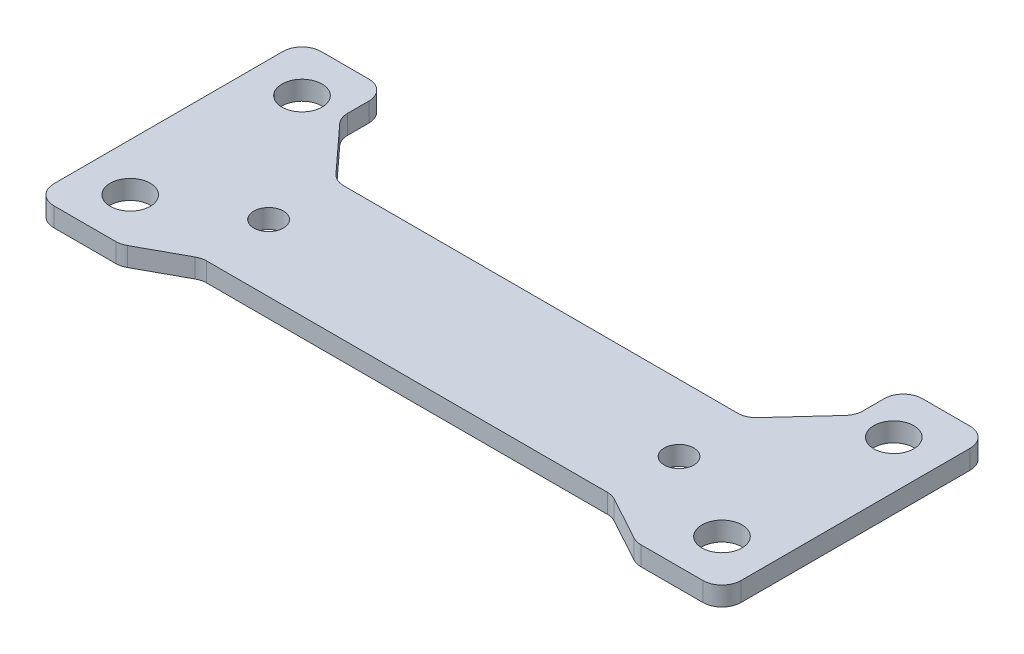
ISO-10303-21;
HEADER;
FILE_DESCRIPTION(('STEP AP214'),'2;1');
FILE_NAME('part.step','',(''),(''),'','','');
FILE_SCHEMA(('AUTOMOTIVE_DESIGN { 1 0 10303 214 1 1 1 1 }'));
ENDSEC;
DATA;
#1=APPLICATION_CONTEXT('core data for automotive mechanical design processes');
#2=APPLICATION_PROTOCOL_DEFINITION('international standard','automotive_design',2000,#1);
#3=PRODUCT_CONTEXT('',#1,'mechanical');
#4=PRODUCT('Part','Part','',(#3));
#5=PRODUCT_RELATED_PRODUCT_CATEGORY('part','',(#4));
#6=PRODUCT_DEFINITION_FORMATION('','',#4);
#7=PRODUCT_DEFINITION_CONTEXT('part definition',#1,'design');
#8=PRODUCT_DEFINITION('design','',#6,#7);
#9=PRODUCT_DEFINITION_SHAPE('','',#8);
#10=(LENGTH_UNIT() NAMED_UNIT(*) SI_UNIT(.MILLI.,.METRE.));
#11=(NAMED_UNIT(*) PLANE_ANGLE_UNIT() SI_UNIT($,.RADIAN.));
#12=(NAMED_UNIT(*) SI_UNIT($,.STERADIAN.) SOLID_ANGLE_UNIT());
#13=UNCERTAINTY_MEASURE_WITH_UNIT(LENGTH_MEASURE(1.E-05),#10,'distance_accuracy_value','');
#14=(GEOMETRIC_REPRESENTATION_CONTEXT(3) GLOBAL_UNCERTAINTY_ASSIGNED_CONTEXT((#13)) GLOBAL_UNIT_ASSIGNED_CONTEXT((#10,
#11,#12)) REPRESENTATION_CONTEXT('',''));
#15=CARTESIAN_POINT('',(0.,0.,0.));
#16=DIRECTION('',(0.,0.,1.));
#17=DIRECTION('',(1.,0.,0.));
#18=AXIS2_PLACEMENT_3D('',#15,#16,#17);
#19=CARTESIAN_POINT('',(0.,2.,5.));
#20=DIRECTION('',(0.,0.,-1.));
#21=DIRECTION('',(-1.,0.,0.));
#22=AXIS2_PLACEMENT_3D('',#19,#20,#21);
#23=PLANE('',#22);
#24=DIRECTION('',(1.,0.,0.));
#25=VECTOR('',#24,1.);
#26=CARTESIAN_POINT('',(0.,2.,5.));
#27=LINE('',#26,#25);
#28=CARTESIAN_POINT('',(-3.4900119712861,2.,5.));
#29=VERTEX_POINT('',#28);
#30=CARTESIAN_POINT('',(2.99999999999999,2.,5.));
#31=VERTEX_POINT('',#30);
#32=EDGE_CURVE('E242',#29,#31,#27,.T.);
#33=ORIENTED_EDGE('',*,*,#32,.F.);
#34=DIRECTION('',(0.,-1.,0.));
#35=VECTOR('',#34,1.);
#36=CARTESIAN_POINT('',(-3.4900119712861,2.,5.));
#37=LINE('',#36,#35);
#38=CARTESIAN_POINT('',(-3.4900119712861,0.,5.));
#39=VERTEX_POINT('',#38);
#40=EDGE_CURVE('E227',#29,#39,#37,.T.);
#41=ORIENTED_EDGE('',*,*,#40,.T.);
#42=DIRECTION('',(1.,0.,0.));
#43=VECTOR('',#42,1.);
#44=CARTESIAN_POINT('',(0.,0.,5.));
#45=LINE('',#44,#43);
#46=CARTESIAN_POINT('',(2.99999999999999,0.,5.));
#47=VERTEX_POINT('',#46);
#48=EDGE_CURVE('E239',#39,#47,#45,.T.);
#49=ORIENTED_EDGE('',*,*,#48,.T.);
#50=DIRECTION('',(0.,-1.,0.));
#51=VECTOR('',#50,1.);
#52=CARTESIAN_POINT('',(2.99999999999999,2.,5.));
#53=LINE('',#52,#51);
#54=EDGE_CURVE('E244',#47,#31,#53,.F.);
#55=ORIENTED_EDGE('',*,*,#54,.T.);
#56=EDGE_LOOP('',(#33,#41,#49,#55));
#57=FACE_BOUND('',#56,.T.);
#58=ADVANCED_FACE('F37',(#57),#23,.F.);
#59=CARTESIAN_POINT('',(4.99999999999999,2.,0.));
#60=DIRECTION('',(1.,0.,0.));
#61=DIRECTION('',(0.,0.,-1.));
#62=AXIS2_PLACEMENT_3D('',#59,#60,#61);
#63=PLANE('',#62);
#64=DIRECTION('',(0.,0.,1.));
#65=VECTOR('',#64,1.);
#66=CARTESIAN_POINT('',(4.99999999999999,2.,0.));
#67=LINE('',#66,#65);
#68=CARTESIAN_POINT('',(4.99999999999999,2.,-21.));
#69=VERTEX_POINT('',#68);
#70=CARTESIAN_POINT('',(4.99999999999999,2.,3.));
#71=VERTEX_POINT('',#70);
#72=EDGE_CURVE('E593',#69,#71,#67,.T.);
#73=ORIENTED_EDGE('',*,*,#72,.T.);
#74=DIRECTION('',(0.,-1.,0.));
#75=VECTOR('',#74,1.);
#76=CARTESIAN_POINT('',(4.99999999999999,0.,3.));
#77=LINE('',#76,#75);
#78=CARTESIAN_POINT('',(4.99999999999999,0.,3.));
#79=VERTEX_POINT('',#78);
#80=EDGE_CURVE('E381',#71,#79,#77,.T.);
#81=ORIENTED_EDGE('',*,*,#80,.T.);
#82=DIRECTION('',(0.,0.,1.));
#83=VECTOR('',#82,1.);
#84=CARTESIAN_POINT('',(4.99999999999999,0.,0.));
#85=LINE('',#84,#83);
#86=CARTESIAN_POINT('',(4.99999999999999,0.,-21.));
#87=VERTEX_POINT('',#86);
#88=EDGE_CURVE('E250',#87,#79,#85,.T.);
#89=ORIENTED_EDGE('',*,*,#88,.F.);
#90=DIRECTION('',(0.,-1.,0.));
#91=VECTOR('',#90,1.);
#92=CARTESIAN_POINT('',(4.99999999999999,2.,-21.));
#93=LINE('',#92,#91);
#94=EDGE_CURVE('E379',#87,#69,#93,.F.);
#95=ORIENTED_EDGE('',*,*,#94,.T.);
#96=EDGE_LOOP('',(#73,#81,#89,#95));
#97=FACE_BOUND('',#96,.T.);
#98=ADVANCED_FACE('F501',(#97),#63,.T.);
#99=CARTESIAN_POINT('',(0.,2.,-23.));
#100=DIRECTION('',(0.,0.,-1.));
#101=DIRECTION('',(-1.,0.,0.));
#102=AXIS2_PLACEMENT_3D('',#99,#100,#101);
#103=PLANE('',#102);
#104=DIRECTION('',(1.,0.,0.));
#105=VECTOR('',#104,1.);
#106=CARTESIAN_POINT('',(0.,2.,-23.));
#107=LINE('',#106,#105);
#108=CARTESIAN_POINT('',(-1.99999999999999,2.,-23.));
#109=VERTEX_POINT('',#108);
#110=CARTESIAN_POINT('',(2.99999999999999,2.,-23.));
#111=VERTEX_POINT('',#110);
#112=EDGE_CURVE('E445',#109,#111,#107,.T.);
#113=ORIENTED_EDGE('',*,*,#112,.T.);
#114=DIRECTION('',(0.,-1.,0.));
#115=VECTOR('',#114,1.);
#116=CARTESIAN_POINT('',(2.99999999999999,2.,-23.));
#117=LINE('',#116,#115);
#118=CARTESIAN_POINT('',(2.99999999999999,0.,-23.));
#119=VERTEX_POINT('',#118);
#120=EDGE_CURVE('E391',#111,#119,#117,.T.);
#121=ORIENTED_EDGE('',*,*,#120,.T.);
#122=DIRECTION('',(1.,0.,0.));
#123=VECTOR('',#122,1.);
#124=CARTESIAN_POINT('',(0.,0.,-23.));
#125=LINE('',#124,#123);
#126=CARTESIAN_POINT('',(-1.99999999999999,0.,-23.));
#127=VERTEX_POINT('',#126);
#128=EDGE_CURVE('E252',#127,#119,#125,.T.);
#129=ORIENTED_EDGE('',*,*,#128,.F.);
#130=DIRECTION('',(0.,-1.,0.));
#131=VECTOR('',#130,1.);
#132=CARTESIAN_POINT('',(-1.99999999999999,2.,-23.));
#133=LINE('',#132,#131);
#134=EDGE_CURVE('E389',#127,#109,#133,.F.);
#135=ORIENTED_EDGE('',*,*,#134,.T.);
#136=EDGE_LOOP('',(#113,#121,#129,#135));
#137=FACE_BOUND('',#136,.T.);
#138=ADVANCED_FACE('F506',(#137),#103,.T.);
#139=CARTESIAN_POINT('',(-3.99999999999999,2.,0.));
#140=DIRECTION('',(1.,0.,0.));
#141=DIRECTION('',(0.,0.,-1.));
#142=AXIS2_PLACEMENT_3D('',#139,#140,#141);
#143=PLANE('',#142);
#144=DIRECTION('',(0.,0.,1.));
#145=VECTOR('',#144,1.);
#146=CARTESIAN_POINT('',(-3.99999999999999,0.,0.));
#147=LINE('',#146,#145);
#148=CARTESIAN_POINT('',(-3.99999999999999,0.,-21.));
#149=VERTEX_POINT('',#148);
#150=CARTESIAN_POINT('',(-3.99999999999999,0.,-18.777967381109));
#151=VERTEX_POINT('',#150);
#152=EDGE_CURVE('E260',#149,#151,#147,.T.);
#153=ORIENTED_EDGE('',*,*,#152,.T.);
#154=DIRECTION('',(0.,-1.,0.));
#155=VECTOR('',#154,1.);
#156=CARTESIAN_POINT('',(-3.99999999999999,2.,-18.777967381109));
#157=LINE('',#156,#155);
#158=CARTESIAN_POINT('',(-3.99999999999999,2.,-18.777967381109));
#159=VERTEX_POINT('',#158);
#160=EDGE_CURVE('E377',#151,#159,#157,.F.);
#161=ORIENTED_EDGE('',*,*,#160,.T.);
#162=DIRECTION('',(0.,0.,1.));
#163=VECTOR('',#162,1.);
#164=CARTESIAN_POINT('',(-3.99999999999999,2.,0.));
#165=LINE('',#164,#163);
#166=CARTESIAN_POINT('',(-3.99999999999999,2.,-21.));
#167=VERTEX_POINT('',#166);
#168=EDGE_CURVE('E436',#167,#159,#165,.T.);
#169=ORIENTED_EDGE('',*,*,#168,.F.);
#170=DIRECTION('',(0.,-1.,0.));
#171=VECTOR('',#170,1.);
#172=CARTESIAN_POINT('',(-3.99999999999999,0.,-21.));
#173=LINE('',#172,#171);
#174=EDGE_CURVE('E374',#167,#149,#173,.T.);
#175=ORIENTED_EDGE('',*,*,#174,.T.);
#176=EDGE_LOOP('',(#153,#161,#169,#175));
#177=FACE_BOUND('',#176,.T.);
#178=ADVANCED_FACE('F423',(#177),#143,.F.);
#179=CARTESIAN_POINT('',(-11.1396226415094,2.,-10.211320754717));
#180=DIRECTION('',(-0.737154140200741,0.,-0.675724628517347));
#181=DIRECTION('',(-0.675724628517347,0.,0.737154140200741));
#182=AXIS2_PLACEMENT_3D('',#179,#180,#181);
#183=PLANE('',#182);
#184=DIRECTION('',(0.675724628517347,0.,-0.737154140200741));
#185=VECTOR('',#184,1.);
#186=CARTESIAN_POINT('',(-11.1396226415094,0.,-10.211320754717));
#187=LINE('',#186,#185);
#188=CARTESIAN_POINT('',(-8.90549515228179,0.,-12.6485507429653));
#189=VERTEX_POINT('',#188);
#190=CARTESIAN_POINT('',(-4.52569171959851,0.,-17.4265181240743));
#191=VERTEX_POINT('',#190);
#192=EDGE_CURVE('E263',#189,#191,#187,.T.);
#193=ORIENTED_EDGE('',*,*,#192,.F.);
#194=DIRECTION('',(0.,-1.,0.));
#195=VECTOR('',#194,1.);
#196=CARTESIAN_POINT('',(-8.90549515228179,2.,-12.6485507429653));
#197=LINE('',#196,#195);
#198=CARTESIAN_POINT('',(-8.90549515228179,2.,-12.6485507429653));
#199=VERTEX_POINT('',#198);
#200=EDGE_CURVE('E372',#189,#199,#197,.F.);
#201=ORIENTED_EDGE('',*,*,#200,.T.);
#202=DIRECTION('',(0.675724628517347,0.,-0.737154140200741));
#203=VECTOR('',#202,1.);
#204=CARTESIAN_POINT('',(-11.1396226415094,2.,-10.211320754717));
#205=LINE('',#204,#203);
#206=CARTESIAN_POINT('',(-4.52569171959851,2.,-17.4265181240743));
#207=VERTEX_POINT('',#206);
#208=EDGE_CURVE('E434',#199,#207,#205,.T.);
#209=ORIENTED_EDGE('',*,*,#208,.T.);
#210=DIRECTION('',(0.,-1.,0.));
#211=VECTOR('',#210,1.);
#212=CARTESIAN_POINT('',(-4.52569171959851,2.,-17.4265181240743));
#213=LINE('',#212,#211);
#214=EDGE_CURVE('E369',#207,#191,#213,.T.);
#215=ORIENTED_EDGE('',*,*,#214,.T.);
#216=EDGE_LOOP('',(#193,#201,#209,#215));
#217=FACE_BOUND('',#216,.T.);
#218=ADVANCED_FACE('F438',(#217),#183,.T.);
#219=CARTESIAN_POINT('',(0.,2.,-12.));
#220=DIRECTION('',(0.,0.,1.));
#221=DIRECTION('',(1.,0.,0.));
#222=AXIS2_PLACEMENT_3D('',#219,#220,#221);
#223=PLANE('',#222);
#224=DIRECTION('',(-1.,0.,0.));
#225=VECTOR('',#224,1.);
#226=CARTESIAN_POINT('',(0.,0.,-12.));
#227=LINE('',#226,#225);
#228=CARTESIAN_POINT('',(-10.3798034326833,0.,-12.));
#229=VERTEX_POINT('',#228);
#230=CARTESIAN_POINT('',(-51.6201965673167,0.,-12.));
#231=VERTEX_POINT('',#230);
#232=EDGE_CURVE('E266',#229,#231,#227,.T.);
#233=ORIENTED_EDGE('',*,*,#232,.T.);
#234=DIRECTION('',(0.,-1.,0.));
#235=VECTOR('',#234,1.);
#236=CARTESIAN_POINT('',(-51.6201965673167,2.,-12.));
#237=LINE('',#236,#235);
#238=CARTESIAN_POINT('',(-51.6201965673167,2.,-12.));
#239=VERTEX_POINT('',#238);
#240=EDGE_CURVE('E367',#231,#239,#237,.F.);
#241=ORIENTED_EDGE('',*,*,#240,.T.);
#242=DIRECTION('',(-1.,0.,0.));
#243=VECTOR('',#242,1.);
#244=CARTESIAN_POINT('',(0.,2.,-12.));
#245=LINE('',#244,#243);
#246=CARTESIAN_POINT('',(-10.3798034326833,2.,-12.));
#247=VERTEX_POINT('',#246);
#248=EDGE_CURVE('E440',#247,#239,#245,.T.);
#249=ORIENTED_EDGE('',*,*,#248,.F.);
#250=DIRECTION('',(0.,-1.,0.));
#251=VECTOR('',#250,1.);
#252=CARTESIAN_POINT('',(-10.3798034326833,2.,-12.));
#253=LINE('',#252,#251);
#254=EDGE_CURVE('E364',#247,#229,#253,.T.);
#255=ORIENTED_EDGE('',*,*,#254,.T.);
#256=EDGE_LOOP('',(#233,#241,#249,#255));
#257=FACE_BOUND('',#256,.T.);
#258=ADVANCED_FACE('F615',(#257),#223,.F.);
#259=CARTESIAN_POINT('',(-22.5509433962264,2.,20.6716981132075));
#260=DIRECTION('',(-0.737154140200741,0.,0.675724628517346));
#261=DIRECTION('',(0.675724628517346,0.,0.737154140200741));
#262=AXIS2_PLACEMENT_3D('',#259,#260,#261);
#263=PLANE('',#262);
#264=DIRECTION('',(-0.675724628517346,0.,-0.737154140200741));
#265=VECTOR('',#264,1.);
#266=CARTESIAN_POINT('',(-22.5509433962264,0.,20.6716981132075));
#267=LINE('',#266,#265);
#268=CARTESIAN_POINT('',(-53.0945048477182,0.,-12.6485507429653));
#269=VERTEX_POINT('',#268);
#270=CARTESIAN_POINT('',(-57.4743082804015,0.,-17.4265181240744));
#271=VERTEX_POINT('',#270);
#272=EDGE_CURVE('E269',#269,#271,#267,.T.);
#273=ORIENTED_EDGE('',*,*,#272,.T.);
#274=DIRECTION('',(0.,-1.,0.));
#275=VECTOR('',#274,1.);
#276=CARTESIAN_POINT('',(-57.4743082804015,2.,-17.4265181240743));
#277=LINE('',#276,#275);
#278=CARTESIAN_POINT('',(-57.4743082804015,2.,-17.4265181240744));
#279=VERTEX_POINT('',#278);
#280=EDGE_CURVE('E362',#271,#279,#277,.F.);
#281=ORIENTED_EDGE('',*,*,#280,.T.);
#282=DIRECTION('',(-0.675724628517346,0.,-0.737154140200741));
#283=VECTOR('',#282,1.);
#284=CARTESIAN_POINT('',(-22.5509433962264,2.,20.6716981132075));
#285=LINE('',#284,#283);
#286=CARTESIAN_POINT('',(-53.0945048477182,2.,-12.6485507429653));
#287=VERTEX_POINT('',#286);
#288=EDGE_CURVE('E443',#287,#279,#285,.T.);
#289=ORIENTED_EDGE('',*,*,#288,.F.);
#290=DIRECTION('',(0.,-1.,0.));
#291=VECTOR('',#290,1.);
#292=CARTESIAN_POINT('',(-53.0945048477182,0.,-12.6485507429653));
#293=LINE('',#292,#291);
#294=EDGE_CURVE('E359',#287,#269,#293,.T.);
#295=ORIENTED_EDGE('',*,*,#294,.T.);
#296=EDGE_LOOP('',(#273,#281,#289,#295));
#297=FACE_BOUND('',#296,.T.);
#298=ADVANCED_FACE('F618',(#297),#263,.F.);
#299=CARTESIAN_POINT('',(-58.,2.,0.));
#300=DIRECTION('',(1.,0.,0.));
#301=DIRECTION('',(0.,0.,-1.));
#302=AXIS2_PLACEMENT_3D('',#299,#300,#301);
#303=PLANE('',#302);
#304=DIRECTION('',(0.,0.,1.));
#305=VECTOR('',#304,1.);
#306=CARTESIAN_POINT('',(-58.,2.,0.));
#307=LINE('',#306,#305);
#308=CARTESIAN_POINT('',(-58.,2.,-21.));
#309=VERTEX_POINT('',#308);
#310=CARTESIAN_POINT('',(-58.,2.,-18.777967381109));
#311=VERTEX_POINT('',#310);
#312=EDGE_CURVE('E451',#309,#311,#307,.T.);
#313=ORIENTED_EDGE('',*,*,#312,.T.);
#314=DIRECTION('',(0.,-1.,0.));
#315=VECTOR('',#314,1.);
#316=CARTESIAN_POINT('',(-58.,2.,-18.777967381109));
#317=LINE('',#316,#315);
#318=CARTESIAN_POINT('',(-58.,0.,-18.777967381109));
#319=VERTEX_POINT('',#318);
#320=EDGE_CURVE('E356',#311,#319,#317,.T.);
#321=ORIENTED_EDGE('',*,*,#320,.T.);
#322=DIRECTION('',(0.,0.,1.));
#323=VECTOR('',#322,1.);
#324=CARTESIAN_POINT('',(-58.,0.,0.));
#325=LINE('',#324,#323);
#326=CARTESIAN_POINT('',(-58.,0.,-21.));
#327=VERTEX_POINT('',#326);
#328=EDGE_CURVE('E272',#327,#319,#325,.T.);
#329=ORIENTED_EDGE('',*,*,#328,.F.);
#330=DIRECTION('',(0.,-1.,0.));
#331=VECTOR('',#330,1.);
#332=CARTESIAN_POINT('',(-58.,2.,-21.));
#333=LINE('',#332,#331);
#334=EDGE_CURVE('E354',#327,#309,#333,.F.);
#335=ORIENTED_EDGE('',*,*,#334,.T.);
#336=EDGE_LOOP('',(#313,#321,#329,#335));
#337=FACE_BOUND('',#336,.T.);
#338=ADVANCED_FACE('F622',(#337),#303,.T.);
#339=CARTESIAN_POINT('',(0.,2.,-23.));
#340=DIRECTION('',(0.,0.,-1.));
#341=DIRECTION('',(-1.,0.,0.));
#342=AXIS2_PLACEMENT_3D('',#339,#340,#341);
#343=PLANE('',#342);
#344=DIRECTION('',(1.,0.,0.));
#345=VECTOR('',#344,1.);
#346=CARTESIAN_POINT('',(0.,2.,-23.));
#347=LINE('',#346,#345);
#348=CARTESIAN_POINT('',(-65.,2.,-23.));
#349=VERTEX_POINT('',#348);
#350=CARTESIAN_POINT('',(-60.,2.,-23.));
#351=VERTEX_POINT('',#350);
#352=EDGE_CURVE('E454',#349,#351,#347,.T.);
#353=ORIENTED_EDGE('',*,*,#352,.T.);
#354=DIRECTION('',(0.,-1.,0.));
#355=VECTOR('',#354,1.);
#356=CARTESIAN_POINT('',(-60.,2.,-23.));
#357=LINE('',#356,#355);
#358=CARTESIAN_POINT('',(-60.,0.,-23.));
#359=VERTEX_POINT('',#358);
#360=EDGE_CURVE('E386',#351,#359,#357,.T.);
#361=ORIENTED_EDGE('',*,*,#360,.T.);
#362=DIRECTION('',(1.,0.,0.));
#363=VECTOR('',#362,1.);
#364=CARTESIAN_POINT('',(0.,0.,-23.));
#365=LINE('',#364,#363);
#366=CARTESIAN_POINT('',(-65.,0.,-23.));
#367=VERTEX_POINT('',#366);
#368=EDGE_CURVE('E275',#367,#359,#365,.T.);
#369=ORIENTED_EDGE('',*,*,#368,.F.);
#370=DIRECTION('',(0.,-1.,0.));
#371=VECTOR('',#370,1.);
#372=CARTESIAN_POINT('',(-65.,2.,-23.));
#373=LINE('',#372,#371);
#374=EDGE_CURVE('E384',#367,#349,#373,.F.);
#375=ORIENTED_EDGE('',*,*,#374,.T.);
#376=EDGE_LOOP('',(#353,#361,#369,#375));
#377=FACE_BOUND('',#376,.T.);
#378=ADVANCED_FACE('F626',(#377),#343,.T.);
#379=CARTESIAN_POINT('',(-67.,2.,0.));
#380=DIRECTION('',(1.,0.,0.));
#381=DIRECTION('',(0.,0.,-1.));
#382=AXIS2_PLACEMENT_3D('',#379,#380,#381);
#383=PLANE('',#382);
#384=DIRECTION('',(0.,0.,1.));
#385=VECTOR('',#384,1.);
#386=CARTESIAN_POINT('',(-67.,2.,0.));
#387=LINE('',#386,#385);
#388=CARTESIAN_POINT('',(-67.,2.,-21.));
#389=VERTEX_POINT('',#388);
#390=CARTESIAN_POINT('',(-67.,2.,3.));
#391=VERTEX_POINT('',#390);
#392=EDGE_CURVE('E457',#389,#391,#387,.T.);
#393=ORIENTED_EDGE('',*,*,#392,.F.);
#394=DIRECTION('',(0.,-1.,0.));
#395=VECTOR('',#394,1.);
#396=CARTESIAN_POINT('',(-67.,0.,-21.));
#397=LINE('',#396,#395);
#398=CARTESIAN_POINT('',(-67.,0.,-21.));
#399=VERTEX_POINT('',#398);
#400=EDGE_CURVE('E396',#389,#399,#397,.T.);
#401=ORIENTED_EDGE('',*,*,#400,.T.);
#402=DIRECTION('',(0.,0.,1.));
#403=VECTOR('',#402,1.);
#404=CARTESIAN_POINT('',(-67.,0.,0.));
#405=LINE('',#404,#403);
#406=CARTESIAN_POINT('',(-67.,0.,3.));
#407=VERTEX_POINT('',#406);
#408=EDGE_CURVE('E278',#399,#407,#405,.T.);
#409=ORIENTED_EDGE('',*,*,#408,.T.);
#410=DIRECTION('',(0.,-1.,0.));
#411=VECTOR('',#410,1.);
#412=CARTESIAN_POINT('',(-67.,2.,3.));
#413=LINE('',#412,#411);
#414=EDGE_CURVE('E394',#407,#391,#413,.F.);
#415=ORIENTED_EDGE('',*,*,#414,.T.);
#416=EDGE_LOOP('',(#393,#401,#409,#415));
#417=FACE_BOUND('',#416,.T.);
#418=ADVANCED_FACE('F568',(#417),#383,.F.);
#419=CARTESIAN_POINT('',(0.,2.,5.));
#420=DIRECTION('',(0.,0.,-1.));
#421=DIRECTION('',(-1.,0.,0.));
#422=AXIS2_PLACEMENT_3D('',#419,#420,#421);
#423=PLANE('',#422);
#424=DIRECTION('',(1.,0.,0.));
#425=VECTOR('',#424,1.);
#426=CARTESIAN_POINT('',(0.,0.,5.));
#427=LINE('',#426,#425);
#428=CARTESIAN_POINT('',(-65.,0.,5.));
#429=VERTEX_POINT('',#428);
#430=CARTESIAN_POINT('',(-58.5099880287139,0.,5.));
#431=VERTEX_POINT('',#430);
#432=EDGE_CURVE('E281',#429,#431,#427,.T.);
#433=ORIENTED_EDGE('',*,*,#432,.T.);
#434=DIRECTION('',(0.,-1.,0.));
#435=VECTOR('',#434,1.);
#436=CARTESIAN_POINT('',(-58.5099880287139,2.,5.));
#437=LINE('',#436,#435);
#438=CARTESIAN_POINT('',(-58.5099880287139,2.,5.));
#439=VERTEX_POINT('',#438);
#440=EDGE_CURVE('E352',#431,#439,#437,.F.);
#441=ORIENTED_EDGE('',*,*,#440,.T.);
#442=DIRECTION('',(1.,0.,0.));
#443=VECTOR('',#442,1.);
#444=CARTESIAN_POINT('',(0.,2.,5.));
#445=LINE('',#444,#443);
#446=CARTESIAN_POINT('',(-65.,2.,5.));
#447=VERTEX_POINT('',#446);
#448=EDGE_CURVE('E460',#447,#439,#445,.T.);
#449=ORIENTED_EDGE('',*,*,#448,.F.);
#450=DIRECTION('',(0.,-1.,0.));
#451=VECTOR('',#450,1.);
#452=CARTESIAN_POINT('',(-65.,2.,5.));
#453=LINE('',#452,#451);
#454=EDGE_CURVE('E349',#447,#429,#453,.T.);
#455=ORIENTED_EDGE('',*,*,#454,.T.);
#456=EDGE_LOOP('',(#433,#441,#449,#455));
#457=FACE_BOUND('',#456,.T.);
#458=ADVANCED_FACE('F575',(#457),#423,.F.);
#459=CARTESIAN_POINT('',(-11.1974522292994,2.,-20.5286624203822));
#460=DIRECTION('',(0.478852130680574,0.,0.877895572914384));
#461=DIRECTION('',(0.877895572914384,0.,-0.478852130680574));
#462=AXIS2_PLACEMENT_3D('',#459,#460,#461);
#463=PLANE('',#462);
#464=DIRECTION('',(-0.877895572914384,0.,0.478852130680574));
#465=VECTOR('',#464,1.);
#466=CARTESIAN_POINT('',(-11.1974522292994,2.,-20.5286624203822));
#467=LINE('',#466,#465);
#468=CARTESIAN_POINT('',(-52.9477162326473,2.,2.24420885417123));
#469=VERTEX_POINT('',#468);
#470=CARTESIAN_POINT('',(-57.5522837673527,2.,4.75579114582877));
#471=VERTEX_POINT('',#470);
#472=EDGE_CURVE('E463',#469,#471,#467,.T.);
#473=ORIENTED_EDGE('',*,*,#472,.T.);
#474=DIRECTION('',(0.,-1.,0.));
#475=VECTOR('',#474,1.);
#476=CARTESIAN_POINT('',(-57.5522837673527,0.,4.75579114582877));
#477=LINE('',#476,#475);
#478=CARTESIAN_POINT('',(-57.5522837673527,0.,4.75579114582877));
#479=VERTEX_POINT('',#478);
#480=EDGE_CURVE('E346',#471,#479,#477,.T.);
#481=ORIENTED_EDGE('',*,*,#480,.T.);
#482=DIRECTION('',(-0.877895572914384,0.,0.478852130680574));
#483=VECTOR('',#482,1.);
#484=CARTESIAN_POINT('',(-11.1974522292994,0.,-20.5286624203822));
#485=LINE('',#484,#483);
#486=CARTESIAN_POINT('',(-52.9477162326473,0.,2.24420885417123));
#487=VERTEX_POINT('',#486);
#488=EDGE_CURVE('E284',#487,#479,#485,.T.);
#489=ORIENTED_EDGE('',*,*,#488,.F.);
#490=DIRECTION('',(0.,-1.,0.));
#491=VECTOR('',#490,1.);
#492=CARTESIAN_POINT('',(-52.9477162326473,2.,2.24420885417123));
#493=LINE('',#492,#491);
#494=EDGE_CURVE('E344',#487,#469,#493,.F.);
#495=ORIENTED_EDGE('',*,*,#494,.T.);
#496=EDGE_LOOP('',(#473,#481,#489,#495));
#497=FACE_BOUND('',#496,.T.);
#498=ADVANCED_FACE('F580',(#497),#463,.T.);
#499=CARTESIAN_POINT('',(0.,2.,2.));
#500=DIRECTION('',(0.,0.,-1.));
#501=DIRECTION('',(-1.,0.,0.));
#502=AXIS2_PLACEMENT_3D('',#499,#500,#501);
#503=PLANE('',#502);
#504=DIRECTION('',(1.,0.,0.));
#505=VECTOR('',#504,1.);
#506=CARTESIAN_POINT('',(0.,0.,2.));
#507=LINE('',#506,#505);
#508=CARTESIAN_POINT('',(-51.9900119712861,0.,2.));
#509=VERTEX_POINT('',#508);
#510=CARTESIAN_POINT('',(-10.0099880287139,0.,2.));
#511=VERTEX_POINT('',#510);
#512=EDGE_CURVE('E287',#509,#511,#507,.T.);
#513=ORIENTED_EDGE('',*,*,#512,.T.);
#514=DIRECTION('',(0.,-1.,0.));
#515=VECTOR('',#514,1.);
#516=CARTESIAN_POINT('',(-10.0099880287139,2.,2.));
#517=LINE('',#516,#515);
#518=CARTESIAN_POINT('',(-10.0099880287139,2.,2.));
#519=VERTEX_POINT('',#518);
#520=EDGE_CURVE('E52',#511,#519,#517,.F.);
#521=ORIENTED_EDGE('',*,*,#520,.T.);
#522=DIRECTION('',(1.,0.,0.));
#523=VECTOR('',#522,1.);
#524=CARTESIAN_POINT('',(0.,2.,2.));
#525=LINE('',#524,#523);
#526=CARTESIAN_POINT('',(-51.9900119712861,2.,2.));
#527=VERTEX_POINT('',#526);
#528=EDGE_CURVE('E466',#527,#519,#525,.T.);
#529=ORIENTED_EDGE('',*,*,#528,.F.);
#530=DIRECTION('',(0.,-1.,0.));
#531=VECTOR('',#530,1.);
#532=CARTESIAN_POINT('',(-51.9900119712861,2.,2.));
#533=LINE('',#532,#531);
#534=EDGE_CURVE('E340',#527,#509,#533,.T.);
#535=ORIENTED_EDGE('',*,*,#534,.T.);
#536=EDGE_LOOP('',(#513,#521,#529,#535));
#537=FACE_BOUND('',#536,.T.);
#538=ADVANCED_FACE('F585',(#537),#503,.F.);
#539=CARTESIAN_POINT('',(-52.5,2.,-5.));
#540=DIRECTION('',(0.,-1.,0.));
#541=DIRECTION('',(0.,0.,-1.));
#542=AXIS2_PLACEMENT_3D('',#539,#540,#541);
#543=CYLINDRICAL_SURFACE('',#542,1.55);
#544=CARTESIAN_POINT('',(-52.5,2.,-5.));
#545=DIRECTION('',(0.,1.,0.));
#546=DIRECTION('',(0.,0.,1.));
#547=AXIS2_PLACEMENT_3D('',#544,#545,#546);
#548=CIRCLE('',#547,1.55);
#549=CARTESIAN_POINT('',(-52.5,2.,-3.45));
#550=VERTEX_POINT('',#549);
#551=EDGE_CURVE('E481',#550,#550,#548,.T.);
#552=ORIENTED_EDGE('',*,*,#551,.T.);
#553=EDGE_LOOP('',(#552));
#554=FACE_BOUND('',#553,.T.);
#555=CARTESIAN_POINT('',(-52.5,0.,-5.));
#556=DIRECTION('',(0.,1.,0.));
#557=DIRECTION('',(0.,0.,1.));
#558=AXIS2_PLACEMENT_3D('',#555,#556,#557);
#559=CIRCLE('',#558,1.55);
#560=CARTESIAN_POINT('',(-52.5,0.,-3.45));
#561=VERTEX_POINT('',#560);
#562=EDGE_CURVE('E303',#561,#561,#559,.T.);
#563=ORIENTED_EDGE('',*,*,#562,.F.);
#564=EDGE_LOOP('',(#563));
#565=FACE_BOUND('',#564,.T.);
#566=ADVANCED_FACE('F639',(#554,#565),#543,.F.);
#567=CARTESIAN_POINT('',(-9.49999999999999,2.,-5.));
#568=DIRECTION('',(0.,-1.,0.));
#569=DIRECTION('',(0.,0.,-1.));
#570=AXIS2_PLACEMENT_3D('',#567,#568,#569);
#571=CYLINDRICAL_SURFACE('',#570,1.55);
#572=CARTESIAN_POINT('',(-9.49999999999999,2.,-5.));
#573=DIRECTION('',(0.,1.,0.));
#574=DIRECTION('',(0.,0.,1.));
#575=AXIS2_PLACEMENT_3D('',#572,#573,#574);
#576=CIRCLE('',#575,1.55);
#577=CARTESIAN_POINT('',(-9.49999999999999,2.,-3.45));
#578=VERTEX_POINT('',#577);
#579=EDGE_CURVE('E479',#578,#578,#576,.T.);
#580=ORIENTED_EDGE('',*,*,#579,.T.);
#581=EDGE_LOOP('',(#580));
#582=FACE_BOUND('',#581,.T.);
#583=CARTESIAN_POINT('',(-9.49999999999999,0.,-5.));
#584=DIRECTION('',(0.,1.,0.));
#585=DIRECTION('',(0.,0.,1.));
#586=AXIS2_PLACEMENT_3D('',#583,#584,#585);
#587=CIRCLE('',#586,1.55);
#588=CARTESIAN_POINT('',(-9.49999999999999,0.,-3.45));
#589=VERTEX_POINT('',#588);
#590=EDGE_CURVE('E300',#589,#589,#587,.T.);
#591=ORIENTED_EDGE('',*,*,#590,.F.);
#592=EDGE_LOOP('',(#591));
#593=FACE_BOUND('',#592,.T.);
#594=ADVANCED_FACE('F653',(#582,#593),#571,.F.);
#595=CARTESIAN_POINT('',(0.,2.,-18.));
#596=DIRECTION('',(0.,-1.,0.));
#597=DIRECTION('',(0.,0.,-1.));
#598=AXIS2_PLACEMENT_3D('',#595,#596,#597);
#599=CYLINDRICAL_SURFACE('',#598,2.1);
#600=CARTESIAN_POINT('',(0.,2.,-18.));
#601=DIRECTION('',(0.,1.,0.));
#602=DIRECTION('',(0.,0.,1.));
#603=AXIS2_PLACEMENT_3D('',#600,#601,#602);
#604=CIRCLE('',#603,2.1);
#605=CARTESIAN_POINT('',(0.,2.,-15.9));
#606=VERTEX_POINT('',#605);
#607=EDGE_CURVE('E476',#606,#606,#604,.T.);
#608=ORIENTED_EDGE('',*,*,#607,.T.);
#609=EDGE_LOOP('',(#608));
#610=FACE_BOUND('',#609,.T.);
#611=CARTESIAN_POINT('',(0.,0.,-18.));
#612=DIRECTION('',(0.,1.,0.));
#613=DIRECTION('',(0.,0.,1.));
#614=AXIS2_PLACEMENT_3D('',#611,#612,#613);
#615=CIRCLE('',#614,2.1);
#616=CARTESIAN_POINT('',(0.,0.,-15.9));
#617=VERTEX_POINT('',#616);
#618=EDGE_CURVE('E297',#617,#617,#615,.T.);
#619=ORIENTED_EDGE('',*,*,#618,.F.);
#620=EDGE_LOOP('',(#619));
#621=FACE_BOUND('',#620,.T.);
#622=ADVANCED_FACE('F649',(#610,#621),#599,.F.);
#623=CARTESIAN_POINT('',(0.,2.,0.));
#624=DIRECTION('',(0.,-1.,0.));
#625=DIRECTION('',(0.,0.,-1.));
#626=AXIS2_PLACEMENT_3D('',#623,#624,#625);
#627=CYLINDRICAL_SURFACE('',#626,2.1);
#628=CARTESIAN_POINT('',(0.,2.,0.));
#629=DIRECTION('',(0.,1.,0.));
#630=DIRECTION('',(0.,0.,1.));
#631=AXIS2_PLACEMENT_3D('',#628,#629,#630);
#632=CIRCLE('',#631,2.1);
#633=CARTESIAN_POINT('',(0.,2.,2.1));
#634=VERTEX_POINT('',#633);
#635=EDGE_CURVE('E473',#634,#634,#632,.T.);
#636=ORIENTED_EDGE('',*,*,#635,.T.);
#637=EDGE_LOOP('',(#636));
#638=FACE_BOUND('',#637,.T.);
#639=CARTESIAN_POINT('',(0.,0.,0.));
#640=DIRECTION('',(0.,1.,0.));
#641=DIRECTION('',(0.,0.,1.));
#642=AXIS2_PLACEMENT_3D('',#639,#640,#641);
#643=CIRCLE('',#642,2.1);
#644=CARTESIAN_POINT('',(0.,0.,2.1));
#645=VERTEX_POINT('',#644);
#646=EDGE_CURVE('E294',#645,#645,#643,.T.);
#647=ORIENTED_EDGE('',*,*,#646,.F.);
#648=EDGE_LOOP('',(#647));
#649=FACE_BOUND('',#648,.T.);
#650=ADVANCED_FACE('F645',(#638,#649),#627,.F.);
#651=CARTESIAN_POINT('',(-62.,2.,0.));
#652=DIRECTION('',(0.,-1.,0.));
#653=DIRECTION('',(0.,0.,-1.));
#654=AXIS2_PLACEMENT_3D('',#651,#652,#653);
#655=CYLINDRICAL_SURFACE('',#654,2.1);
#656=CARTESIAN_POINT('',(-62.,2.,0.));
#657=DIRECTION('',(0.,1.,0.));
#658=DIRECTION('',(0.,0.,1.));
#659=AXIS2_PLACEMENT_3D('',#656,#657,#658);
#660=CIRCLE('',#659,2.1);
#661=CARTESIAN_POINT('',(-62.,2.,2.1));
#662=VERTEX_POINT('',#661);
#663=EDGE_CURVE('E470',#662,#662,#660,.T.);
#664=ORIENTED_EDGE('',*,*,#663,.T.);
#665=EDGE_LOOP('',(#664));
#666=FACE_BOUND('',#665,.T.);
#667=CARTESIAN_POINT('',(-62.,0.,0.));
#668=DIRECTION('',(0.,1.,0.));
#669=DIRECTION('',(0.,0.,1.));
#670=AXIS2_PLACEMENT_3D('',#667,#668,#669);
#671=CIRCLE('',#670,2.1);
#672=CARTESIAN_POINT('',(-62.,0.,2.1));
#673=VERTEX_POINT('',#672);
#674=EDGE_CURVE('E291',#673,#673,#671,.T.);
#675=ORIENTED_EDGE('',*,*,#674,.F.);
#676=EDGE_LOOP('',(#675));
#677=FACE_BOUND('',#676,.T.);
#678=ADVANCED_FACE('F642',(#666,#677),#655,.F.);
#679=CARTESIAN_POINT('',(-3.01910828025478,2.,5.53503184713375));
#680=DIRECTION('',(0.478852130680574,0.,-0.877895572914384));
#681=DIRECTION('',(-0.877895572914384,0.,-0.478852130680574));
#682=AXIS2_PLACEMENT_3D('',#679,#680,#681);
#683=PLANE('',#682);
#684=DIRECTION('',(0.877895572914384,0.,0.478852130680574));
#685=VECTOR('',#684,1.);
#686=CARTESIAN_POINT('',(-3.01910828025478,0.,5.53503184713375));
#687=LINE('',#686,#685);
#688=CARTESIAN_POINT('',(-9.05228376735273,0.,2.24420885417123));
#689=VERTEX_POINT('',#688);
#690=CARTESIAN_POINT('',(-4.44771623264725,0.,4.75579114582877));
#691=VERTEX_POINT('',#690);
#692=EDGE_CURVE('E289',#689,#691,#687,.T.);
#693=ORIENTED_EDGE('',*,*,#692,.T.);
#694=DIRECTION('',(0.,-1.,0.));
#695=VECTOR('',#694,1.);
#696=CARTESIAN_POINT('',(-4.44771623264725,2.,4.75579114582877));
#697=LINE('',#696,#695);
#698=CARTESIAN_POINT('',(-4.44771623264725,2.,4.75579114582877));
#699=VERTEX_POINT('',#698);
#700=EDGE_CURVE('E228',#691,#699,#697,.F.);
#701=ORIENTED_EDGE('',*,*,#700,.T.);
#702=DIRECTION('',(0.877895572914384,0.,0.478852130680574));
#703=VECTOR('',#702,1.);
#704=CARTESIAN_POINT('',(-3.01910828025478,2.,5.53503184713375));
#705=LINE('',#704,#703);
#706=CARTESIAN_POINT('',(-9.05228376735273,2.,2.24420885417123));
#707=VERTEX_POINT('',#706);
#708=EDGE_CURVE('E468',#707,#699,#705,.T.);
#709=ORIENTED_EDGE('',*,*,#708,.F.);
#710=DIRECTION('',(0.,-1.,0.));
#711=VECTOR('',#710,1.);
#712=CARTESIAN_POINT('',(-9.05228376735273,0.,2.24420885417123));
#713=LINE('',#712,#711);
#714=EDGE_CURVE('E233',#707,#689,#713,.T.);
#715=ORIENTED_EDGE('',*,*,#714,.T.);
#716=EDGE_LOOP('',(#693,#701,#709,#715));
#717=FACE_BOUND('',#716,.T.);
#718=ADVANCED_FACE('F498',(#717),#683,.F.);
#719=CARTESIAN_POINT('',(-62.,2.,-18.));
#720=DIRECTION('',(0.,-1.,0.));
#721=DIRECTION('',(0.,0.,-1.));
#722=AXIS2_PLACEMENT_3D('',#719,#720,#721);
#723=CYLINDRICAL_SURFACE('',#722,2.1);
#724=CARTESIAN_POINT('',(-62.,2.,-18.));
#725=DIRECTION('',(0.,1.,0.));
#726=DIRECTION('',(0.,0.,1.));
#727=AXIS2_PLACEMENT_3D('',#724,#725,#726);
#728=CIRCLE('',#727,2.1);
#729=CARTESIAN_POINT('',(-62.,2.,-15.9));
#730=VERTEX_POINT('',#729);
#731=EDGE_CURVE('E255',#730,#730,#728,.T.);
#732=ORIENTED_EDGE('',*,*,#731,.T.);
#733=EDGE_LOOP('',(#732));
#734=FACE_BOUND('',#733,.T.);
#735=CARTESIAN_POINT('',(-62.,0.,-18.));
#736=DIRECTION('',(0.,1.,0.));
#737=DIRECTION('',(0.,0.,1.));
#738=AXIS2_PLACEMENT_3D('',#735,#736,#737);
#739=CIRCLE('',#738,2.1);
#740=CARTESIAN_POINT('',(-62.,0.,-15.9));
#741=VERTEX_POINT('',#740);
#742=EDGE_CURVE('E306',#741,#741,#739,.T.);
#743=ORIENTED_EDGE('',*,*,#742,.F.);
#744=EDGE_LOOP('',(#743));
#745=FACE_BOUND('',#744,.T.);
#746=ADVANCED_FACE('F488',(#734,#745),#723,.F.);
#747=CARTESIAN_POINT('',(0.,2.,0.));
#748=DIRECTION('',(0.,1.,0.));
#749=DIRECTION('',(0.,0.,1.));
#750=AXIS2_PLACEMENT_3D('',#747,#748,#749);
#751=PLANE('',#750);
#752=ORIENTED_EDGE('',*,*,#708,.T.);
#753=CARTESIAN_POINT('',(-3.4900119712861,2.,3.));
#754=DIRECTION('',(0.,1.,0.));
#755=DIRECTION('',(0.,0.,1.));
#756=AXIS2_PLACEMENT_3D('',#753,#754,#755);
#757=CIRCLE('',#756,2.);
#758=EDGE_CURVE('E338',#699,#29,#757,.T.);
#759=ORIENTED_EDGE('',*,*,#758,.T.);
#760=ORIENTED_EDGE('',*,*,#32,.T.);
#761=CARTESIAN_POINT('',(2.99999999999999,2.,3.));
#762=DIRECTION('',(0.,1.,0.));
#763=DIRECTION('',(0.,0.,1.));
#764=AXIS2_PLACEMENT_3D('',#761,#762,#763);
#765=CIRCLE('',#764,2.);
#766=EDGE_CURVE('E334',#31,#71,#765,.T.);
#767=ORIENTED_EDGE('',*,*,#766,.T.);
#768=ORIENTED_EDGE('',*,*,#72,.F.);
#769=CARTESIAN_POINT('',(2.99999999999999,2.,-21.));
#770=DIRECTION('',(0.,1.,0.));
#771=DIRECTION('',(0.,0.,1.));
#772=AXIS2_PLACEMENT_3D('',#769,#770,#771);
#773=CIRCLE('',#772,2.);
#774=EDGE_CURVE('E330',#69,#111,#773,.T.);
#775=ORIENTED_EDGE('',*,*,#774,.T.);
#776=ORIENTED_EDGE('',*,*,#112,.F.);
#777=CARTESIAN_POINT('',(-1.99999999999999,2.,-21.));
#778=DIRECTION('',(0.,1.,0.));
#779=DIRECTION('',(0.,0.,1.));
#780=AXIS2_PLACEMENT_3D('',#777,#778,#779);
#781=CIRCLE('',#780,2.);
#782=EDGE_CURVE('E328',#109,#167,#781,.T.);
#783=ORIENTED_EDGE('',*,*,#782,.T.);
#784=ORIENTED_EDGE('',*,*,#168,.T.);
#785=CARTESIAN_POINT('',(-5.99999999999999,2.,-18.777967381109));
#786=DIRECTION('',(0.,1.,0.));
#787=DIRECTION('',(0.,0.,1.));
#788=AXIS2_PLACEMENT_3D('',#785,#786,#787);
#789=CIRCLE('',#788,2.);
#790=EDGE_CURVE('E11',#159,#207,#789,.F.);
#791=ORIENTED_EDGE('',*,*,#790,.T.);
#792=ORIENTED_EDGE('',*,*,#208,.F.);
#793=CARTESIAN_POINT('',(-10.3798034326833,2.,-14.));
#794=DIRECTION('',(0.,1.,0.));
#795=DIRECTION('',(0.,0.,1.));
#796=AXIS2_PLACEMENT_3D('',#793,#794,#795);
#797=CIRCLE('',#796,2.);
#798=EDGE_CURVE('E416',#199,#247,#797,.F.);
#799=ORIENTED_EDGE('',*,*,#798,.T.);
#800=ORIENTED_EDGE('',*,*,#248,.T.);
#801=CARTESIAN_POINT('',(-51.6201965673167,2.,-14.));
#802=DIRECTION('',(0.,1.,0.));
#803=DIRECTION('',(0.,0.,1.));
#804=AXIS2_PLACEMENT_3D('',#801,#802,#803);
#805=CIRCLE('',#804,2.);
#806=EDGE_CURVE('E412',#239,#287,#805,.F.);
#807=ORIENTED_EDGE('',*,*,#806,.T.);
#808=ORIENTED_EDGE('',*,*,#288,.T.);
#809=CARTESIAN_POINT('',(-56.,2.,-18.777967381109));
#810=DIRECTION('',(0.,1.,0.));
#811=DIRECTION('',(0.,0.,1.));
#812=AXIS2_PLACEMENT_3D('',#809,#810,#811);
#813=CIRCLE('',#812,2.);
#814=EDGE_CURVE('E408',#279,#311,#813,.F.);
#815=ORIENTED_EDGE('',*,*,#814,.T.);
#816=ORIENTED_EDGE('',*,*,#312,.F.);
#817=CARTESIAN_POINT('',(-60.,2.,-21.));
#818=DIRECTION('',(0.,1.,0.));
#819=DIRECTION('',(0.,0.,1.));
#820=AXIS2_PLACEMENT_3D('',#817,#818,#819);
#821=CIRCLE('',#820,2.);
#822=EDGE_CURVE('E332',#309,#351,#821,.T.);
#823=ORIENTED_EDGE('',*,*,#822,.T.);
#824=ORIENTED_EDGE('',*,*,#352,.F.);
#825=CARTESIAN_POINT('',(-65.,2.,-21.));
#826=DIRECTION('',(0.,1.,0.));
#827=DIRECTION('',(0.,0.,1.));
#828=AXIS2_PLACEMENT_3D('',#825,#826,#827);
#829=CIRCLE('',#828,2.);
#830=EDGE_CURVE('E326',#349,#389,#829,.T.);
#831=ORIENTED_EDGE('',*,*,#830,.T.);
#832=ORIENTED_EDGE('',*,*,#392,.T.);
#833=CARTESIAN_POINT('',(-65.,2.,3.));
#834=DIRECTION('',(0.,1.,0.));
#835=DIRECTION('',(0.,0.,1.));
#836=AXIS2_PLACEMENT_3D('',#833,#834,#835);
#837=CIRCLE('',#836,2.);
#838=EDGE_CURVE('E324',#391,#447,#837,.T.);
#839=ORIENTED_EDGE('',*,*,#838,.T.);
#840=ORIENTED_EDGE('',*,*,#448,.T.);
#841=CARTESIAN_POINT('',(-58.5099880287139,2.,3.));
#842=DIRECTION('',(0.,1.,0.));
#843=DIRECTION('',(0.,0.,1.));
#844=AXIS2_PLACEMENT_3D('',#841,#842,#843);
#845=CIRCLE('',#844,2.);
#846=EDGE_CURVE('E336',#439,#471,#845,.T.);
#847=ORIENTED_EDGE('',*,*,#846,.T.);
#848=ORIENTED_EDGE('',*,*,#472,.F.);
#849=CARTESIAN_POINT('',(-51.9900119712861,2.,4.));
#850=DIRECTION('',(0.,1.,0.));
#851=DIRECTION('',(0.,0.,1.));
#852=AXIS2_PLACEMENT_3D('',#849,#850,#851);
#853=CIRCLE('',#852,2.);
#854=EDGE_CURVE('E59',#469,#527,#853,.F.);
#855=ORIENTED_EDGE('',*,*,#854,.T.);
#856=ORIENTED_EDGE('',*,*,#528,.T.);
#857=CARTESIAN_POINT('',(-10.0099880287139,2.,4.));
#858=DIRECTION('',(0.,1.,0.));
#859=DIRECTION('',(0.,0.,1.));
#860=AXIS2_PLACEMENT_3D('',#857,#858,#859);
#861=CIRCLE('',#860,2.);
#862=EDGE_CURVE('E401',#519,#707,#861,.F.);
#863=ORIENTED_EDGE('',*,*,#862,.T.);
#864=EDGE_LOOP('',(#752,#759,#760,#767,#768,#775,#776,#783,#784,#791,#792,#799,#800,#807,#808,
#815,#816,#823,#824,#831,#832,#839,#840,#847,#848,#855,#856,#863));
#865=FACE_BOUND('',#864,.T.);
#866=ORIENTED_EDGE('',*,*,#663,.F.);
#867=EDGE_LOOP('',(#866));
#868=FACE_BOUND('',#867,.T.);
#869=ORIENTED_EDGE('',*,*,#635,.F.);
#870=EDGE_LOOP('',(#869));
#871=FACE_BOUND('',#870,.T.);
#872=ORIENTED_EDGE('',*,*,#607,.F.);
#873=EDGE_LOOP('',(#872));
#874=FACE_BOUND('',#873,.T.);
#875=ORIENTED_EDGE('',*,*,#579,.F.);
#876=EDGE_LOOP('',(#875));
#877=FACE_BOUND('',#876,.T.);
#878=ORIENTED_EDGE('',*,*,#551,.F.);
#879=EDGE_LOOP('',(#878));
#880=FACE_BOUND('',#879,.T.);
#881=ORIENTED_EDGE('',*,*,#731,.F.);
#882=EDGE_LOOP('',(#881));
#883=FACE_BOUND('',#882,.T.);
#884=ADVANCED_FACE('F432',(#865,#868,#871,#874,#877,#880,#883),#751,.T.);
#885=CARTESIAN_POINT('',(0.,0.,0.));
#886=DIRECTION('',(0.,1.,0.));
#887=DIRECTION('',(0.,0.,1.));
#888=AXIS2_PLACEMENT_3D('',#885,#886,#887);
#889=PLANE('',#888);
#890=ORIENTED_EDGE('',*,*,#48,.F.);
#891=CARTESIAN_POINT('',(-3.4900119712861,0.,3.));
#892=DIRECTION('',(0.,1.,0.));
#893=DIRECTION('',(0.,0.,1.));
#894=AXIS2_PLACEMENT_3D('',#891,#892,#893);
#895=CIRCLE('',#894,2.);
#896=EDGE_CURVE('E223',#39,#691,#895,.F.);
#897=ORIENTED_EDGE('',*,*,#896,.T.);
#898=ORIENTED_EDGE('',*,*,#692,.F.);
#899=CARTESIAN_POINT('',(-10.0099880287139,0.,4.));
#900=DIRECTION('',(0.,1.,0.));
#901=DIRECTION('',(0.,0.,1.));
#902=AXIS2_PLACEMENT_3D('',#899,#900,#901);
#903=CIRCLE('',#902,2.);
#904=EDGE_CURVE('E399',#689,#511,#903,.T.);
#905=ORIENTED_EDGE('',*,*,#904,.T.);
#906=ORIENTED_EDGE('',*,*,#512,.F.);
#907=CARTESIAN_POINT('',(-51.9900119712861,0.,4.));
#908=DIRECTION('',(0.,1.,0.));
#909=DIRECTION('',(0.,0.,1.));
#910=AXIS2_PLACEMENT_3D('',#907,#908,#909);
#911=CIRCLE('',#910,2.);
#912=EDGE_CURVE('E403',#509,#487,#911,.T.);
#913=ORIENTED_EDGE('',*,*,#912,.T.);
#914=ORIENTED_EDGE('',*,*,#488,.T.);
#915=CARTESIAN_POINT('',(-58.5099880287139,0.,3.));
#916=DIRECTION('',(0.,1.,0.));
#917=DIRECTION('',(0.,0.,1.));
#918=AXIS2_PLACEMENT_3D('',#915,#916,#917);
#919=CIRCLE('',#918,2.);
#920=EDGE_CURVE('E234',#479,#431,#919,.F.);
#921=ORIENTED_EDGE('',*,*,#920,.T.);
#922=ORIENTED_EDGE('',*,*,#432,.F.);
#923=CARTESIAN_POINT('',(-65.,0.,3.));
#924=DIRECTION('',(0.,1.,0.));
#925=DIRECTION('',(0.,0.,1.));
#926=AXIS2_PLACEMENT_3D('',#923,#924,#925);
#927=CIRCLE('',#926,2.);
#928=EDGE_CURVE('E243',#429,#407,#927,.F.);
#929=ORIENTED_EDGE('',*,*,#928,.T.);
#930=ORIENTED_EDGE('',*,*,#408,.F.);
#931=CARTESIAN_POINT('',(-65.,0.,-21.));
#932=DIRECTION('',(0.,1.,0.));
#933=DIRECTION('',(0.,0.,1.));
#934=AXIS2_PLACEMENT_3D('',#931,#932,#933);
#935=CIRCLE('',#934,2.);
#936=EDGE_CURVE('E311',#399,#367,#935,.F.);
#937=ORIENTED_EDGE('',*,*,#936,.T.);
#938=ORIENTED_EDGE('',*,*,#368,.T.);
#939=CARTESIAN_POINT('',(-60.,0.,-21.));
#940=DIRECTION('',(0.,1.,0.));
#941=DIRECTION('',(0.,0.,1.));
#942=AXIS2_PLACEMENT_3D('',#939,#940,#941);
#943=CIRCLE('',#942,2.);
#944=EDGE_CURVE('E317',#359,#327,#943,.F.);
#945=ORIENTED_EDGE('',*,*,#944,.T.);
#946=ORIENTED_EDGE('',*,*,#328,.T.);
#947=CARTESIAN_POINT('',(-56.,0.,-18.777967381109));
#948=DIRECTION('',(0.,1.,0.));
#949=DIRECTION('',(0.,0.,1.));
#950=AXIS2_PLACEMENT_3D('',#947,#948,#949);
#951=CIRCLE('',#950,2.);
#952=EDGE_CURVE('E406',#319,#271,#951,.T.);
#953=ORIENTED_EDGE('',*,*,#952,.T.);
#954=ORIENTED_EDGE('',*,*,#272,.F.);
#955=CARTESIAN_POINT('',(-51.6201965673167,0.,-14.));
#956=DIRECTION('',(0.,1.,0.));
#957=DIRECTION('',(0.,0.,1.));
#958=AXIS2_PLACEMENT_3D('',#955,#956,#957);
#959=CIRCLE('',#958,2.);
#960=EDGE_CURVE('E410',#269,#231,#959,.T.);
#961=ORIENTED_EDGE('',*,*,#960,.T.);
#962=ORIENTED_EDGE('',*,*,#232,.F.);
#963=CARTESIAN_POINT('',(-10.3798034326833,0.,-14.));
#964=DIRECTION('',(0.,1.,0.));
#965=DIRECTION('',(0.,0.,1.));
#966=AXIS2_PLACEMENT_3D('',#963,#964,#965);
#967=CIRCLE('',#966,2.);
#968=EDGE_CURVE('E414',#229,#189,#967,.T.);
#969=ORIENTED_EDGE('',*,*,#968,.T.);
#970=ORIENTED_EDGE('',*,*,#192,.T.);
#971=CARTESIAN_POINT('',(-5.99999999999999,0.,-18.777967381109));
#972=DIRECTION('',(0.,1.,0.));
#973=DIRECTION('',(0.,0.,1.));
#974=AXIS2_PLACEMENT_3D('',#971,#972,#973);
#975=CIRCLE('',#974,2.);
#976=EDGE_CURVE('E45',#191,#151,#975,.T.);
#977=ORIENTED_EDGE('',*,*,#976,.T.);
#978=ORIENTED_EDGE('',*,*,#152,.F.);
#979=CARTESIAN_POINT('',(-1.99999999999999,0.,-21.));
#980=DIRECTION('',(0.,1.,0.));
#981=DIRECTION('',(0.,0.,1.));
#982=AXIS2_PLACEMENT_3D('',#979,#980,#981);
#983=CIRCLE('',#982,2.);
#984=EDGE_CURVE('E313',#149,#127,#983,.F.);
#985=ORIENTED_EDGE('',*,*,#984,.T.);
#986=ORIENTED_EDGE('',*,*,#128,.T.);
#987=CARTESIAN_POINT('',(2.99999999999999,0.,-21.));
#988=DIRECTION('',(0.,1.,0.));
#989=DIRECTION('',(0.,0.,1.));
#990=AXIS2_PLACEMENT_3D('',#987,#988,#989);
#991=CIRCLE('',#990,2.);
#992=EDGE_CURVE('E315',#119,#87,#991,.F.);
#993=ORIENTED_EDGE('',*,*,#992,.T.);
#994=ORIENTED_EDGE('',*,*,#88,.T.);
#995=CARTESIAN_POINT('',(2.99999999999999,0.,3.));
#996=DIRECTION('',(0.,1.,0.));
#997=DIRECTION('',(0.,0.,1.));
#998=AXIS2_PLACEMENT_3D('',#995,#996,#997);
#999=CIRCLE('',#998,2.);
#1000=EDGE_CURVE('E249',#79,#47,#999,.F.);
#1001=ORIENTED_EDGE('',*,*,#1000,.T.);
#1002=EDGE_LOOP('',(#890,#897,#898,#905,#906,#913,#914,#921,#922,#929,#930,#937,#938,#945,#946,
#953,#954,#961,#962,#969,#970,#977,#978,#985,#986,#993,#994,#1001));
#1003=FACE_BOUND('',#1002,.T.);
#1004=ORIENTED_EDGE('',*,*,#674,.T.);
#1005=EDGE_LOOP('',(#1004));
#1006=FACE_BOUND('',#1005,.T.);
#1007=ORIENTED_EDGE('',*,*,#646,.T.);
#1008=EDGE_LOOP('',(#1007));
#1009=FACE_BOUND('',#1008,.T.);
#1010=ORIENTED_EDGE('',*,*,#618,.T.);
#1011=EDGE_LOOP('',(#1010));
#1012=FACE_BOUND('',#1011,.T.);
#1013=ORIENTED_EDGE('',*,*,#590,.T.);
#1014=EDGE_LOOP('',(#1013));
#1015=FACE_BOUND('',#1014,.T.);
#1016=ORIENTED_EDGE('',*,*,#562,.T.);
#1017=EDGE_LOOP('',(#1016));
#1018=FACE_BOUND('',#1017,.T.);
#1019=ORIENTED_EDGE('',*,*,#742,.T.);
#1020=EDGE_LOOP('',(#1019));
#1021=FACE_BOUND('',#1020,.T.);
#1022=ADVANCED_FACE('F246',(#1003,#1006,#1009,#1012,#1015,#1018,#1021),#889,.F.);
#1023=CARTESIAN_POINT('',(-3.4900119712861,2.,3.));
#1024=DIRECTION('',(0.,-1.,0.));
#1025=DIRECTION('',(0.,0.,-1.));
#1026=AXIS2_PLACEMENT_3D('',#1023,#1024,#1025);
#1027=CYLINDRICAL_SURFACE('',#1026,2.);
#1028=ORIENTED_EDGE('',*,*,#758,.F.);
#1029=ORIENTED_EDGE('',*,*,#700,.F.);
#1030=ORIENTED_EDGE('',*,*,#896,.F.);
#1031=ORIENTED_EDGE('',*,*,#40,.F.);
#1032=EDGE_LOOP('',(#1028,#1029,#1030,#1031));
#1033=FACE_BOUND('',#1032,.T.);
#1034=ADVANCED_FACE('F226',(#1033),#1027,.T.);
#1035=CARTESIAN_POINT('',(-10.0099880287139,2.,4.));
#1036=DIRECTION('',(0.,1.,0.));
#1037=DIRECTION('',(0.,0.,1.));
#1038=AXIS2_PLACEMENT_3D('',#1035,#1036,#1037);
#1039=CYLINDRICAL_SURFACE('',#1038,2.);
#1040=ORIENTED_EDGE('',*,*,#862,.F.);
#1041=ORIENTED_EDGE('',*,*,#520,.F.);
#1042=ORIENTED_EDGE('',*,*,#904,.F.);
#1043=ORIENTED_EDGE('',*,*,#714,.F.);
#1044=EDGE_LOOP('',(#1040,#1041,#1042,#1043));
#1045=FACE_BOUND('',#1044,.T.);
#1046=ADVANCED_FACE('F513',(#1045),#1039,.F.);
#1047=CARTESIAN_POINT('',(-58.5099880287139,2.,3.));
#1048=DIRECTION('',(0.,1.,0.));
#1049=DIRECTION('',(0.,0.,1.));
#1050=AXIS2_PLACEMENT_3D('',#1047,#1048,#1049);
#1051=CYLINDRICAL_SURFACE('',#1050,2.);
#1052=ORIENTED_EDGE('',*,*,#846,.F.);
#1053=ORIENTED_EDGE('',*,*,#440,.F.);
#1054=ORIENTED_EDGE('',*,*,#920,.F.);
#1055=ORIENTED_EDGE('',*,*,#480,.F.);
#1056=EDGE_LOOP('',(#1052,#1053,#1054,#1055));
#1057=FACE_BOUND('',#1056,.T.);
#1058=ADVANCED_FACE('F516',(#1057),#1051,.T.);
#1059=CARTESIAN_POINT('',(-51.9900119712861,2.,4.));
#1060=DIRECTION('',(0.,-1.,0.));
#1061=DIRECTION('',(0.,0.,-1.));
#1062=AXIS2_PLACEMENT_3D('',#1059,#1060,#1061);
#1063=CYLINDRICAL_SURFACE('',#1062,2.);
#1064=ORIENTED_EDGE('',*,*,#854,.F.);
#1065=ORIENTED_EDGE('',*,*,#494,.F.);
#1066=ORIENTED_EDGE('',*,*,#912,.F.);
#1067=ORIENTED_EDGE('',*,*,#534,.F.);
#1068=EDGE_LOOP('',(#1064,#1065,#1066,#1067));
#1069=FACE_BOUND('',#1068,.T.);
#1070=ADVANCED_FACE('F520',(#1069),#1063,.F.);
#1071=CARTESIAN_POINT('',(-56.,2.,-18.777967381109));
#1072=DIRECTION('',(0.,-1.,0.));
#1073=DIRECTION('',(0.,0.,-1.));
#1074=AXIS2_PLACEMENT_3D('',#1071,#1072,#1073);
#1075=CYLINDRICAL_SURFACE('',#1074,2.);
#1076=ORIENTED_EDGE('',*,*,#814,.F.);
#1077=ORIENTED_EDGE('',*,*,#280,.F.);
#1078=ORIENTED_EDGE('',*,*,#952,.F.);
#1079=ORIENTED_EDGE('',*,*,#320,.F.);
#1080=EDGE_LOOP('',(#1076,#1077,#1078,#1079));
#1081=FACE_BOUND('',#1080,.T.);
#1082=ADVANCED_FACE('F524',(#1081),#1075,.F.);
#1083=CARTESIAN_POINT('',(-51.6201965673167,2.,-14.));
#1084=DIRECTION('',(0.,1.,0.));
#1085=DIRECTION('',(0.,0.,1.));
#1086=AXIS2_PLACEMENT_3D('',#1083,#1084,#1085);
#1087=CYLINDRICAL_SURFACE('',#1086,2.);
#1088=ORIENTED_EDGE('',*,*,#806,.F.);
#1089=ORIENTED_EDGE('',*,*,#240,.F.);
#1090=ORIENTED_EDGE('',*,*,#960,.F.);
#1091=ORIENTED_EDGE('',*,*,#294,.F.);
#1092=EDGE_LOOP('',(#1088,#1089,#1090,#1091));
#1093=FACE_BOUND('',#1092,.T.);
#1094=ADVANCED_FACE('F528',(#1093),#1087,.F.);
#1095=CARTESIAN_POINT('',(-10.3798034326833,2.,-14.));
#1096=DIRECTION('',(0.,-1.,0.));
#1097=DIRECTION('',(0.,0.,-1.));
#1098=AXIS2_PLACEMENT_3D('',#1095,#1096,#1097);
#1099=CYLINDRICAL_SURFACE('',#1098,2.);
#1100=ORIENTED_EDGE('',*,*,#798,.F.);
#1101=ORIENTED_EDGE('',*,*,#200,.F.);
#1102=ORIENTED_EDGE('',*,*,#968,.F.);
#1103=ORIENTED_EDGE('',*,*,#254,.F.);
#1104=EDGE_LOOP('',(#1100,#1101,#1102,#1103));
#1105=FACE_BOUND('',#1104,.T.);
#1106=ADVANCED_FACE('F532',(#1105),#1099,.F.);
#1107=CARTESIAN_POINT('',(-5.99999999999999,2.,-18.777967381109));
#1108=DIRECTION('',(0.,-1.,0.));
#1109=DIRECTION('',(0.,0.,-1.));
#1110=AXIS2_PLACEMENT_3D('',#1107,#1108,#1109);
#1111=CYLINDRICAL_SURFACE('',#1110,2.);
#1112=ORIENTED_EDGE('',*,*,#790,.F.);
#1113=ORIENTED_EDGE('',*,*,#160,.F.);
#1114=ORIENTED_EDGE('',*,*,#976,.F.);
#1115=ORIENTED_EDGE('',*,*,#214,.F.);
#1116=EDGE_LOOP('',(#1112,#1113,#1114,#1115));
#1117=FACE_BOUND('',#1116,.T.);
#1118=ADVANCED_FACE('F428',(#1117),#1111,.F.);
#1119=CARTESIAN_POINT('',(2.99999999999999,2.,3.));
#1120=DIRECTION('',(0.,1.,0.));
#1121=DIRECTION('',(0.,0.,1.));
#1122=AXIS2_PLACEMENT_3D('',#1119,#1120,#1121);
#1123=CYLINDRICAL_SURFACE('',#1122,2.);
#1124=ORIENTED_EDGE('',*,*,#766,.F.);
#1125=ORIENTED_EDGE('',*,*,#54,.F.);
#1126=ORIENTED_EDGE('',*,*,#1000,.F.);
#1127=ORIENTED_EDGE('',*,*,#80,.F.);
#1128=EDGE_LOOP('',(#1124,#1125,#1126,#1127));
#1129=FACE_BOUND('',#1128,.T.);
#1130=ADVANCED_FACE('F539',(#1129),#1123,.T.);
#1131=CARTESIAN_POINT('',(-60.,2.,-21.));
#1132=DIRECTION('',(0.,-1.,0.));
#1133=DIRECTION('',(0.,0.,-1.));
#1134=AXIS2_PLACEMENT_3D('',#1131,#1132,#1133);
#1135=CYLINDRICAL_SURFACE('',#1134,2.);
#1136=ORIENTED_EDGE('',*,*,#822,.F.);
#1137=ORIENTED_EDGE('',*,*,#334,.F.);
#1138=ORIENTED_EDGE('',*,*,#944,.F.);
#1139=ORIENTED_EDGE('',*,*,#360,.F.);
#1140=EDGE_LOOP('',(#1136,#1137,#1138,#1139));
#1141=FACE_BOUND('',#1140,.T.);
#1142=ADVANCED_FACE('F542',(#1141),#1135,.T.);
#1143=CARTESIAN_POINT('',(2.99999999999999,2.,-21.));
#1144=DIRECTION('',(0.,-1.,0.));
#1145=DIRECTION('',(0.,0.,-1.));
#1146=AXIS2_PLACEMENT_3D('',#1143,#1144,#1145);
#1147=CYLINDRICAL_SURFACE('',#1146,2.);
#1148=ORIENTED_EDGE('',*,*,#774,.F.);
#1149=ORIENTED_EDGE('',*,*,#94,.F.);
#1150=ORIENTED_EDGE('',*,*,#992,.F.);
#1151=ORIENTED_EDGE('',*,*,#120,.F.);
#1152=EDGE_LOOP('',(#1148,#1149,#1150,#1151));
#1153=FACE_BOUND('',#1152,.T.);
#1154=ADVANCED_FACE('F546',(#1153),#1147,.T.);
#1155=CARTESIAN_POINT('',(-1.99999999999999,2.,-21.));
#1156=DIRECTION('',(0.,1.,0.));
#1157=DIRECTION('',(0.,0.,1.));
#1158=AXIS2_PLACEMENT_3D('',#1155,#1156,#1157);
#1159=CYLINDRICAL_SURFACE('',#1158,2.);
#1160=ORIENTED_EDGE('',*,*,#782,.F.);
#1161=ORIENTED_EDGE('',*,*,#134,.F.);
#1162=ORIENTED_EDGE('',*,*,#984,.F.);
#1163=ORIENTED_EDGE('',*,*,#174,.F.);
#1164=EDGE_LOOP('',(#1160,#1161,#1162,#1163));
#1165=FACE_BOUND('',#1164,.T.);
#1166=ADVANCED_FACE('F550',(#1165),#1159,.T.);
#1167=CARTESIAN_POINT('',(-65.,2.,-21.));
#1168=DIRECTION('',(0.,1.,0.));
#1169=DIRECTION('',(0.,0.,1.));
#1170=AXIS2_PLACEMENT_3D('',#1167,#1168,#1169);
#1171=CYLINDRICAL_SURFACE('',#1170,2.);
#1172=ORIENTED_EDGE('',*,*,#830,.F.);
#1173=ORIENTED_EDGE('',*,*,#374,.F.);
#1174=ORIENTED_EDGE('',*,*,#936,.F.);
#1175=ORIENTED_EDGE('',*,*,#400,.F.);
#1176=EDGE_LOOP('',(#1172,#1173,#1174,#1175));
#1177=FACE_BOUND('',#1176,.T.);
#1178=ADVANCED_FACE('F553',(#1177),#1171,.T.);
#1179=CARTESIAN_POINT('',(-65.,2.,3.));
#1180=DIRECTION('',(0.,-1.,0.));
#1181=DIRECTION('',(0.,0.,-1.));
#1182=AXIS2_PLACEMENT_3D('',#1179,#1180,#1181);
#1183=CYLINDRICAL_SURFACE('',#1182,2.);
#1184=ORIENTED_EDGE('',*,*,#838,.F.);
#1185=ORIENTED_EDGE('',*,*,#414,.F.);
#1186=ORIENTED_EDGE('',*,*,#928,.F.);
#1187=ORIENTED_EDGE('',*,*,#454,.F.);
#1188=EDGE_LOOP('',(#1184,#1185,#1186,#1187));
#1189=FACE_BOUND('',#1188,.T.);
#1190=ADVANCED_FACE('F39',(#1189),#1183,.T.);
#1191=CLOSED_SHELL('',(#58,#98,#138,#178,#218,#258,#298,#338,#378,#418,#458,#498,#538,#566,#594,
#622,#650,#678,#718,#746,#884,#1022,#1034,#1046,#1058,#1070,#1082,#1094,#1106,#1118,#1130,#1142,
#1154,#1166,#1178,#1190));
#1192=MANIFOLD_SOLID_BREP('B2',#1191);
#1193=ADVANCED_BREP_SHAPE_REPRESENTATION('',(#18,#1192),#14);
#1194=SHAPE_DEFINITION_REPRESENTATION(#9,#1193);
ENDSEC;
END-ISO-10303-21;
